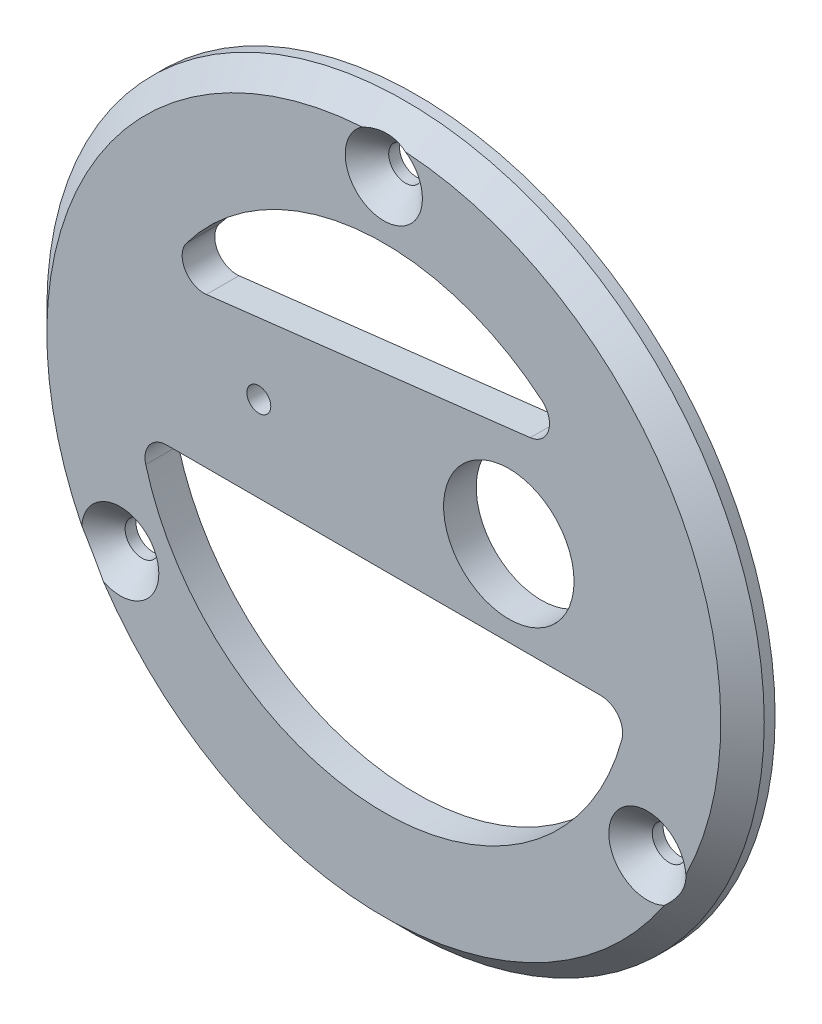
ISO-10303-21;
HEADER;
FILE_DESCRIPTION(('STEP AP214'),'2;1');
FILE_NAME('part.step','',(''),(''),'','','');
FILE_SCHEMA(('AUTOMOTIVE_DESIGN { 1 0 10303 214 1 1 1 1 }'));
ENDSEC;
DATA;
#1=APPLICATION_CONTEXT('core data for automotive mechanical design processes');
#2=APPLICATION_PROTOCOL_DEFINITION('international standard','automotive_design',2000,#1);
#3=PRODUCT_CONTEXT('',#1,'mechanical');
#4=PRODUCT('Part','Part','',(#3));
#5=PRODUCT_RELATED_PRODUCT_CATEGORY('part','',(#4));
#6=PRODUCT_DEFINITION_FORMATION('','',#4);
#7=PRODUCT_DEFINITION_CONTEXT('part definition',#1,'design');
#8=PRODUCT_DEFINITION('design','',#6,#7);
#9=PRODUCT_DEFINITION_SHAPE('','',#8);
#10=(LENGTH_UNIT() NAMED_UNIT(*) SI_UNIT(.MILLI.,.METRE.));
#11=(NAMED_UNIT(*) PLANE_ANGLE_UNIT() SI_UNIT($,.RADIAN.));
#12=(NAMED_UNIT(*) SI_UNIT($,.STERADIAN.) SOLID_ANGLE_UNIT());
#13=UNCERTAINTY_MEASURE_WITH_UNIT(LENGTH_MEASURE(1.E-05),#10,'distance_accuracy_value','');
#14=(GEOMETRIC_REPRESENTATION_CONTEXT(3) GLOBAL_UNCERTAINTY_ASSIGNED_CONTEXT((#13)) GLOBAL_UNIT_ASSIGNED_CONTEXT((#10,
#11,#12)) REPRESENTATION_CONTEXT('',''));
#15=CARTESIAN_POINT('',(0.,0.,0.));
#16=DIRECTION('',(0.,0.,1.));
#17=DIRECTION('',(1.,0.,0.));
#18=AXIS2_PLACEMENT_3D('',#15,#16,#17);
#19=CARTESIAN_POINT('',(0.,15.45,-3.));
#20=DIRECTION('',(0.,0.,1.));
#21=DIRECTION('',(1.,0.,0.));
#22=AXIS2_PLACEMENT_3D('',#19,#20,#21);
#23=CYLINDRICAL_SURFACE('',#22,33.);
#24=CARTESIAN_POINT('',(0.,15.45,42.));
#25=DIRECTION('',(0.,0.,1.));
#26=DIRECTION('',(1.,0.,0.));
#27=AXIS2_PLACEMENT_3D('',#24,#25,#26);
#28=CIRCLE('',#27,33.);
#29=CARTESIAN_POINT('',(33.,15.45,42.));
#30=VERTEX_POINT('',#29);
#31=EDGE_CURVE('E191',#30,#30,#28,.F.);
#32=ORIENTED_EDGE('',*,*,#31,.T.);
#33=EDGE_LOOP('',(#32));
#34=FACE_BOUND('',#33,.T.);
#35=CARTESIAN_POINT('',(0.,15.45,41.));
#36=DIRECTION('',(0.,0.,1.));
#37=DIRECTION('',(1.,0.,0.));
#38=AXIS2_PLACEMENT_3D('',#35,#36,#37);
#39=CIRCLE('',#38,33.);
#40=CARTESIAN_POINT('',(33.,15.45,41.));
#41=VERTEX_POINT('',#40);
#42=EDGE_CURVE('E175',#41,#41,#39,.T.);
#43=ORIENTED_EDGE('',*,*,#42,.T.);
#44=EDGE_LOOP('',(#43));
#45=FACE_BOUND('',#44,.T.);
#46=ADVANCED_FACE('F47',(#34,#45),#23,.T.);
#47=CARTESIAN_POINT('',(0.,15.45,44.));
#48=DIRECTION('',(0.,0.,1.));
#49=DIRECTION('',(1.,0.,0.));
#50=AXIS2_PLACEMENT_3D('',#47,#48,#49);
#51=PLANE('',#50);
#52=CARTESIAN_POINT('',(-11.5,19.9185842870421,44.));
#53=DIRECTION('',(0.,0.,1.));
#54=DIRECTION('',(1.,0.,0.));
#55=AXIS2_PLACEMENT_3D('',#52,#53,#54);
#56=CIRCLE('',#55,1.1);
#57=CARTESIAN_POINT('',(-10.4,19.9185842870421,44.));
#58=VERTEX_POINT('',#57);
#59=EDGE_CURVE('E232',#58,#58,#56,.T.);
#60=ORIENTED_EDGE('',*,*,#59,.F.);
#61=EDGE_LOOP('',(#60));
#62=FACE_BOUND('',#61,.T.);
#63=DIRECTION('',(0.993216518087136,0.116279612137581,0.));
#64=VECTOR('',#63,1.);
#65=CARTESIAN_POINT('',(-3.2085539649182,27.4062558220451,44.));
#66=LINE('',#65,#64);
#67=CARTESIAN_POINT('',(-16.320482538598,25.8711927807462,44.));
#68=VERTEX_POINT('',#67);
#69=CARTESIAN_POINT('',(13.4720413018586,29.359116162689,44.));
#70=VERTEX_POINT('',#69);
#71=EDGE_CURVE('E158',#68,#70,#66,.T.);
#72=ORIENTED_EDGE('',*,*,#71,.F.);
#73=CARTESIAN_POINT('',(-16.5530417628732,27.8576258169205,44.));
#74=DIRECTION('',(0.,0.,1.));
#75=DIRECTION('',(1.,0.,0.));
#76=AXIS2_PLACEMENT_3D('',#73,#74,#75);
#77=CIRCLE('',#76,2.);
#78=CARTESIAN_POINT('',(-18.1533737595177,29.0571830271092,44.));
#79=VERTEX_POINT('',#78);
#80=EDGE_CURVE('E225',#68,#79,#77,.F.);
#81=ORIENTED_EDGE('',*,*,#80,.T.);
#82=CARTESIAN_POINT('',(0.,15.45,44.));
#83=DIRECTION('',(0.,0.,1.));
#84=DIRECTION('',(1.,0.,0.));
#85=AXIS2_PLACEMENT_3D('',#82,#83,#84);
#86=CIRCLE('',#85,22.6870096924648);
#87=CARTESIAN_POINT('',(14.5194623429193,32.8823154531618,44.));
#88=VERTEX_POINT('',#87);
#89=EDGE_CURVE('E162',#88,#79,#86,.T.);
#90=ORIENTED_EDGE('',*,*,#89,.F.);
#91=CARTESIAN_POINT('',(13.2394820775834,31.3455491988632,44.));
#92=DIRECTION('',(0.,0.,1.));
#93=DIRECTION('',(1.,0.,0.));
#94=AXIS2_PLACEMENT_3D('',#91,#92,#93);
#95=CIRCLE('',#94,2.);
#96=EDGE_CURVE('E221',#88,#70,#95,.F.);
#97=ORIENTED_EDGE('',*,*,#96,.T.);
#98=EDGE_LOOP('',(#72,#81,#90,#97));
#99=FACE_BOUND('',#98,.T.);
#100=DIRECTION('',(-0.999999966814466,-0.000257625828715778,0.));
#101=VECTOR('',#100,1.);
#102=CARTESIAN_POINT('',(-0.00310639577921962,12.0577804314772,44.));
#103=LINE('',#102,#101);
#104=CARTESIAN_POINT('',(19.9727622042191,12.0629267313504,44.));
#105=VERTEX_POINT('',#104);
#106=CARTESIAN_POINT('',(-19.9710143579344,12.05263618247,44.));
#107=VERTEX_POINT('',#106);
#108=EDGE_CURVE('E159',#105,#107,#103,.T.);
#109=ORIENTED_EDGE('',*,*,#108,.F.);
#110=CARTESIAN_POINT('',(19.9732774558765,10.0629267977215,44.));
#111=DIRECTION('',(0.,0.,1.));
#112=DIRECTION('',(1.,0.,0.));
#113=AXIS2_PLACEMENT_3D('',#110,#111,#112);
#114=CIRCLE('',#113,2.);
#115=CARTESIAN_POINT('',(21.9042745166216,9.54210979397241,44.));
#116=VERTEX_POINT('',#115);
#117=EDGE_CURVE('E157',#105,#116,#114,.F.);
#118=ORIENTED_EDGE('',*,*,#117,.T.);
#119=CARTESIAN_POINT('',(0.,15.45,44.));
#120=DIRECTION('',(0.,0.,1.));
#121=DIRECTION('',(1.,0.,0.));
#122=AXIS2_PLACEMENT_3D('',#119,#120,#121);
#123=CIRCLE('',#122,22.6870096924648);
#124=CARTESIAN_POINT('',(-21.9012275588818,9.53082436482338,44.));
#125=VERTEX_POINT('',#124);
#126=EDGE_CURVE('E148',#125,#116,#123,.T.);
#127=ORIENTED_EDGE('',*,*,#126,.F.);
#128=CARTESIAN_POINT('',(-19.970499106277,10.0526362488411,44.));
#129=DIRECTION('',(0.,0.,1.));
#130=DIRECTION('',(1.,0.,0.));
#131=AXIS2_PLACEMENT_3D('',#128,#129,#130);
#132=CIRCLE('',#131,2.);
#133=EDGE_CURVE('E131',#125,#107,#132,.F.);
#134=ORIENTED_EDGE('',*,*,#133,.T.);
#135=EDGE_LOOP('',(#109,#118,#127,#134));
#136=FACE_BOUND('',#135,.T.);
#137=CARTESIAN_POINT('',(0.,15.45,44.));
#138=DIRECTION('',(0.,0.,1.));
#139=DIRECTION('',(1.,0.,0.));
#140=AXIS2_PLACEMENT_3D('',#137,#138,#139);
#141=CIRCLE('',#140,31.);
#142=CARTESIAN_POINT('',(-25.7930347440421,-1.74649262764462,44.));
#143=VERTEX_POINT('',#142);
#144=CARTESIAN_POINT('',(25.7930347440414,-1.74649262764578,44.));
#145=VERTEX_POINT('',#144);
#146=EDGE_CURVE('E189',#143,#145,#141,.T.);
#147=ORIENTED_EDGE('',*,*,#146,.T.);
#148=CARTESIAN_POINT('',(24.2487113059643,1.45,44.));
#149=DIRECTION('',(0.,0.,1.));
#150=DIRECTION('',(1.,0.,0.));
#151=AXIS2_PLACEMENT_3D('',#148,#149,#150);
#152=CIRCLE('',#151,3.54999999999832);
#153=CARTESIAN_POINT('',(27.7891168435537,1.71082298478844,44.));
#154=VERTEX_POINT('',#153);
#155=EDGE_CURVE('E241',#145,#154,#152,.F.);
#156=ORIENTED_EDGE('',*,*,#155,.T.);
#157=CARTESIAN_POINT('',(1.99608209951576,46.3856696428571,44.));
#158=VERTEX_POINT('',#157);
#159=EDGE_CURVE('E182',#154,#158,#141,.T.);
#160=ORIENTED_EDGE('',*,*,#159,.T.);
#161=CARTESIAN_POINT('',(0.,43.45,44.));
#162=DIRECTION('',(0.,0.,1.));
#163=DIRECTION('',(1.,0.,0.));
#164=AXIS2_PLACEMENT_3D('',#161,#162,#163);
#165=CIRCLE('',#164,3.55000000000004);
#166=CARTESIAN_POINT('',(-1.99608209951576,46.3856696428571,44.));
#167=VERTEX_POINT('',#166);
#168=EDGE_CURVE('E235',#158,#167,#165,.F.);
#169=ORIENTED_EDGE('',*,*,#168,.T.);
#170=CARTESIAN_POINT('',(-27.7891168435531,1.71082298478715,44.));
#171=VERTEX_POINT('',#170);
#172=EDGE_CURVE('E190',#167,#171,#141,.T.);
#173=ORIENTED_EDGE('',*,*,#172,.T.);
#174=CARTESIAN_POINT('',(-24.2487113059643,1.44999999999998,44.));
#175=DIRECTION('',(0.,0.,1.));
#176=DIRECTION('',(1.,0.,0.));
#177=AXIS2_PLACEMENT_3D('',#174,#175,#176);
#178=CIRCLE('',#177,3.54999999999758);
#179=EDGE_CURVE('E238',#171,#143,#178,.F.);
#180=ORIENTED_EDGE('',*,*,#179,.T.);
#181=EDGE_LOOP('',(#147,#156,#160,#169,#173,#180));
#182=FACE_BOUND('',#181,.T.);
#183=CARTESIAN_POINT('',(11.4999999999999,19.9185842870421,44.));
#184=DIRECTION('',(0.,0.,1.));
#185=DIRECTION('',(1.,0.,0.));
#186=AXIS2_PLACEMENT_3D('',#183,#184,#185);
#187=CIRCLE('',#186,6.);
#188=CARTESIAN_POINT('',(17.4999999999999,19.9185842870421,44.));
#189=VERTEX_POINT('',#188);
#190=EDGE_CURVE('E179',#189,#189,#187,.T.);
#191=ORIENTED_EDGE('',*,*,#190,.F.);
#192=EDGE_LOOP('',(#191));
#193=FACE_BOUND('',#192,.T.);
#194=ADVANCED_FACE('F155',(#62,#99,#136,#182,#193),#51,.T.);
#195=CARTESIAN_POINT('',(0.,15.45,41.));
#196=DIRECTION('',(0.,0.,1.));
#197=DIRECTION('',(1.,0.,0.));
#198=AXIS2_PLACEMENT_3D('',#195,#196,#197);
#199=PLANE('',#198);
#200=CARTESIAN_POINT('',(-11.5,19.9185842870421,41.));
#201=DIRECTION('',(0.,0.,1.));
#202=DIRECTION('',(1.,0.,0.));
#203=AXIS2_PLACEMENT_3D('',#200,#201,#202);
#204=CIRCLE('',#203,1.1);
#205=CARTESIAN_POINT('',(-10.4,19.9185842870421,41.));
#206=VERTEX_POINT('',#205);
#207=EDGE_CURVE('E164',#206,#206,#204,.T.);
#208=ORIENTED_EDGE('',*,*,#207,.T.);
#209=EDGE_LOOP('',(#208));
#210=FACE_BOUND('',#209,.T.);
#211=DIRECTION('',(0.993216518087136,0.116279612137581,0.));
#212=VECTOR('',#211,1.);
#213=CARTESIAN_POINT('',(-1.42422061836972,27.6151544717176,41.));
#214=LINE('',#213,#212);
#215=CARTESIAN_POINT('',(-16.320482538598,25.8711927807462,41.));
#216=VERTEX_POINT('',#215);
#217=CARTESIAN_POINT('',(13.4720413018586,29.359116162689,41.));
#218=VERTEX_POINT('',#217);
#219=EDGE_CURVE('E201',#216,#218,#214,.T.);
#220=ORIENTED_EDGE('',*,*,#219,.T.);
#221=CARTESIAN_POINT('',(13.2394820775834,31.3455491988632,41.));
#222=DIRECTION('',(0.,0.,1.));
#223=DIRECTION('',(1.,0.,0.));
#224=AXIS2_PLACEMENT_3D('',#221,#222,#223);
#225=CIRCLE('',#224,2.);
#226=CARTESIAN_POINT('',(14.5194623429193,32.8823154531618,41.));
#227=VERTEX_POINT('',#226);
#228=EDGE_CURVE('E223',#218,#227,#225,.T.);
#229=ORIENTED_EDGE('',*,*,#228,.T.);
#230=CARTESIAN_POINT('',(0.,15.45,41.));
#231=DIRECTION('',(0.,0.,1.));
#232=DIRECTION('',(1.,0.,0.));
#233=AXIS2_PLACEMENT_3D('',#230,#231,#232);
#234=CIRCLE('',#233,22.6870096924648);
#235=CARTESIAN_POINT('',(-18.1533737595177,29.0571830271092,41.));
#236=VERTEX_POINT('',#235);
#237=EDGE_CURVE('E198',#227,#236,#234,.T.);
#238=ORIENTED_EDGE('',*,*,#237,.T.);
#239=CARTESIAN_POINT('',(-16.5530417628732,27.8576258169205,41.));
#240=DIRECTION('',(0.,0.,1.));
#241=DIRECTION('',(1.,0.,0.));
#242=AXIS2_PLACEMENT_3D('',#239,#240,#241);
#243=CIRCLE('',#242,2.);
#244=EDGE_CURVE('E227',#236,#216,#243,.T.);
#245=ORIENTED_EDGE('',*,*,#244,.T.);
#246=EDGE_LOOP('',(#220,#229,#238,#245));
#247=FACE_BOUND('',#246,.T.);
#248=DIRECTION('',(-0.999999966814466,-0.000257625828715778,0.));
#249=VECTOR('',#248,1.);
#250=CARTESIAN_POINT('',(0.000873923142350145,12.0577814569102,41.));
#251=LINE('',#250,#249);
#252=CARTESIAN_POINT('',(19.9727622042191,12.0629267313504,41.));
#253=VERTEX_POINT('',#252);
#254=CARTESIAN_POINT('',(-19.9710143579344,12.05263618247,41.));
#255=VERTEX_POINT('',#254);
#256=EDGE_CURVE('E195',#253,#255,#251,.T.);
#257=ORIENTED_EDGE('',*,*,#256,.T.);
#258=CARTESIAN_POINT('',(-19.970499106277,10.0526362488411,41.));
#259=DIRECTION('',(0.,0.,1.));
#260=DIRECTION('',(1.,0.,0.));
#261=AXIS2_PLACEMENT_3D('',#258,#259,#260);
#262=CIRCLE('',#261,2.);
#263=CARTESIAN_POINT('',(-21.9012275588818,9.53082436482338,41.));
#264=VERTEX_POINT('',#263);
#265=EDGE_CURVE('E141',#255,#264,#262,.T.);
#266=ORIENTED_EDGE('',*,*,#265,.T.);
#267=CARTESIAN_POINT('',(0.,15.45,41.));
#268=DIRECTION('',(0.,0.,1.));
#269=DIRECTION('',(1.,0.,0.));
#270=AXIS2_PLACEMENT_3D('',#267,#268,#269);
#271=CIRCLE('',#270,22.6870096924648);
#272=CARTESIAN_POINT('',(21.9042745166216,9.54210979397241,41.));
#273=VERTEX_POINT('',#272);
#274=EDGE_CURVE('E151',#264,#273,#271,.T.);
#275=ORIENTED_EDGE('',*,*,#274,.T.);
#276=CARTESIAN_POINT('',(19.9732774558765,10.0629267977215,41.));
#277=DIRECTION('',(0.,0.,1.));
#278=DIRECTION('',(1.,0.,0.));
#279=AXIS2_PLACEMENT_3D('',#276,#277,#278);
#280=CIRCLE('',#279,2.);
#281=EDGE_CURVE('E219',#273,#253,#280,.T.);
#282=ORIENTED_EDGE('',*,*,#281,.T.);
#283=EDGE_LOOP('',(#257,#266,#275,#282));
#284=FACE_BOUND('',#283,.T.);
#285=CARTESIAN_POINT('',(11.4999999999999,19.9185842870421,41.));
#286=DIRECTION('',(0.,0.,1.));
#287=DIRECTION('',(1.,0.,0.));
#288=AXIS2_PLACEMENT_3D('',#285,#286,#287);
#289=CIRCLE('',#288,6.);
#290=CARTESIAN_POINT('',(17.4999999999999,19.9185842870421,41.));
#291=VERTEX_POINT('',#290);
#292=EDGE_CURVE('E178',#291,#291,#289,.T.);
#293=ORIENTED_EDGE('',*,*,#292,.T.);
#294=EDGE_LOOP('',(#293));
#295=FACE_BOUND('',#294,.T.);
#296=CARTESIAN_POINT('',(24.2487113059643,1.45,41.));
#297=DIRECTION('',(0.,0.,1.));
#298=DIRECTION('',(1.,0.,0.));
#299=AXIS2_PLACEMENT_3D('',#296,#297,#298);
#300=CIRCLE('',#299,1.54999999999826);
#301=CARTESIAN_POINT('',(25.7987113059626,1.45,41.));
#302=VERTEX_POINT('',#301);
#303=EDGE_CURVE('E168',#302,#302,#300,.F.);
#304=ORIENTED_EDGE('',*,*,#303,.F.);
#305=EDGE_LOOP('',(#304));
#306=FACE_BOUND('',#305,.T.);
#307=CARTESIAN_POINT('',(0.,43.45,41.));
#308=DIRECTION('',(0.,0.,1.));
#309=DIRECTION('',(1.,0.,0.));
#310=AXIS2_PLACEMENT_3D('',#307,#308,#309);
#311=CIRCLE('',#310,1.55);
#312=CARTESIAN_POINT('',(1.55,43.45,41.));
#313=VERTEX_POINT('',#312);
#314=EDGE_CURVE('E172',#313,#313,#311,.F.);
#315=ORIENTED_EDGE('',*,*,#314,.F.);
#316=EDGE_LOOP('',(#315));
#317=FACE_BOUND('',#316,.T.);
#318=CARTESIAN_POINT('',(-24.2487113059643,1.44999999999998,41.));
#319=DIRECTION('',(0.,0.,1.));
#320=DIRECTION('',(1.,0.,0.));
#321=AXIS2_PLACEMENT_3D('',#318,#319,#320);
#322=CIRCLE('',#321,1.54999999999759);
#323=CARTESIAN_POINT('',(-22.6987113059667,1.44999999999998,41.));
#324=VERTEX_POINT('',#323);
#325=EDGE_CURVE('E171',#324,#324,#322,.F.);
#326=ORIENTED_EDGE('',*,*,#325,.F.);
#327=EDGE_LOOP('',(#326));
#328=FACE_BOUND('',#327,.T.);
#329=ORIENTED_EDGE('',*,*,#42,.F.);
#330=EDGE_LOOP('',(#329));
#331=FACE_BOUND('',#330,.T.);
#332=ADVANCED_FACE('F294',(#210,#247,#284,#295,#306,#317,#328,#331),#199,.F.);
#333=CARTESIAN_POINT('',(11.4999999999999,19.9185842870421,44.));
#334=DIRECTION('',(0.,0.,-1.));
#335=DIRECTION('',(-1.,0.,0.));
#336=AXIS2_PLACEMENT_3D('',#333,#334,#335);
#337=CYLINDRICAL_SURFACE('',#336,6.);
#338=ORIENTED_EDGE('',*,*,#190,.T.);
#339=EDGE_LOOP('',(#338));
#340=FACE_BOUND('',#339,.T.);
#341=ORIENTED_EDGE('',*,*,#292,.F.);
#342=EDGE_LOOP('',(#341));
#343=FACE_BOUND('',#342,.T.);
#344=ADVANCED_FACE('F302',(#340,#343),#337,.F.);
#345=CARTESIAN_POINT('',(-24.2487113059643,1.44999999999998,-2.));
#346=DIRECTION('',(0.,0.,1.));
#347=DIRECTION('',(1.,0.,0.));
#348=AXIS2_PLACEMENT_3D('',#345,#346,#347);
#349=CYLINDRICAL_SURFACE('',#348,1.54999999999759);
#350=CARTESIAN_POINT('',(-24.2487113059643,1.44999999999998,42.));
#351=DIRECTION('',(0.,0.,1.));
#352=DIRECTION('',(1.,0.,0.));
#353=AXIS2_PLACEMENT_3D('',#350,#351,#352);
#354=CIRCLE('',#353,1.54999999999759);
#355=CARTESIAN_POINT('',(-22.6987113059667,1.44999999999998,42.));
#356=VERTEX_POINT('',#355);
#357=EDGE_CURVE('E56',#356,#356,#354,.T.);
#358=CARTESIAN_POINT('',(-22.6987113059667,1.44999999999998,42.));
#359=CARTESIAN_POINT('',(-22.6987113059667,1.44999999999998,41.9895833333333));
#360=CARTESIAN_POINT('',(-22.6987113059667,1.44999999999998,41.9791666666667));
#361=CARTESIAN_POINT('',(-22.6987113059667,1.44999999999998,41.9583333333333));
#362=CARTESIAN_POINT('',(-22.6987113059667,1.44999999999998,41.9479166666667));
#363=CARTESIAN_POINT('',(-22.6987113059667,1.44999999999998,41.9270833333333));
#364=CARTESIAN_POINT('',(-22.6987113059667,1.44999999999998,41.9166666666667));
#365=CARTESIAN_POINT('',(-22.6987113059667,1.44999999999998,41.8958333333333));
#366=CARTESIAN_POINT('',(-22.6987113059667,1.44999999999998,41.8854166666667));
#367=CARTESIAN_POINT('',(-22.6987113059667,1.44999999999998,41.8645833333333));
#368=CARTESIAN_POINT('',(-22.6987113059667,1.44999999999998,41.8541666666667));
#369=CARTESIAN_POINT('',(-22.6987113059667,1.44999999999998,41.8333333333333));
#370=CARTESIAN_POINT('',(-22.6987113059667,1.44999999999998,41.8229166666667));
#371=CARTESIAN_POINT('',(-22.6987113059667,1.44999999999998,41.8020833333333));
#372=CARTESIAN_POINT('',(-22.6987113059667,1.44999999999998,41.7916666666667));
#373=CARTESIAN_POINT('',(-22.6987113059667,1.44999999999998,41.7708333333333));
#374=CARTESIAN_POINT('',(-22.6987113059667,1.44999999999998,41.7604166666667));
#375=CARTESIAN_POINT('',(-22.6987113059667,1.44999999999998,41.7395833333333));
#376=CARTESIAN_POINT('',(-22.6987113059667,1.44999999999998,41.7291666666667));
#377=CARTESIAN_POINT('',(-22.6987113059667,1.44999999999998,41.7083333333333));
#378=CARTESIAN_POINT('',(-22.6987113059667,1.44999999999998,41.6979166666667));
#379=CARTESIAN_POINT('',(-22.6987113059667,1.44999999999998,41.6770833333333));
#380=CARTESIAN_POINT('',(-22.6987113059667,1.44999999999998,41.6666666666667));
#381=CARTESIAN_POINT('',(-22.6987113059667,1.44999999999998,41.6458333333333));
#382=CARTESIAN_POINT('',(-22.6987113059667,1.44999999999998,41.6354166666667));
#383=CARTESIAN_POINT('',(-22.6987113059667,1.44999999999998,41.6145833333333));
#384=CARTESIAN_POINT('',(-22.6987113059667,1.44999999999998,41.6041666666667));
#385=CARTESIAN_POINT('',(-22.6987113059667,1.44999999999998,41.5833333333333));
#386=CARTESIAN_POINT('',(-22.6987113059667,1.44999999999998,41.5729166666667));
#387=CARTESIAN_POINT('',(-22.6987113059667,1.44999999999998,41.5520833333333));
#388=CARTESIAN_POINT('',(-22.6987113059667,1.44999999999998,41.5416666666667));
#389=CARTESIAN_POINT('',(-22.6987113059667,1.44999999999998,41.5208333333333));
#390=CARTESIAN_POINT('',(-22.6987113059667,1.44999999999998,41.5104166666667));
#391=CARTESIAN_POINT('',(-22.6987113059667,1.44999999999998,41.4895833333333));
#392=CARTESIAN_POINT('',(-22.6987113059667,1.44999999999998,41.4791666666667));
#393=CARTESIAN_POINT('',(-22.6987113059667,1.44999999999998,41.4583333333333));
#394=CARTESIAN_POINT('',(-22.6987113059667,1.44999999999998,41.4479166666667));
#395=CARTESIAN_POINT('',(-22.6987113059667,1.44999999999998,41.4270833333333));
#396=CARTESIAN_POINT('',(-22.6987113059667,1.44999999999998,41.4166666666667));
#397=CARTESIAN_POINT('',(-22.6987113059667,1.44999999999998,41.3958333333333));
#398=CARTESIAN_POINT('',(-22.6987113059667,1.44999999999998,41.3854166666667));
#399=CARTESIAN_POINT('',(-22.6987113059667,1.44999999999998,41.3645833333333));
#400=CARTESIAN_POINT('',(-22.6987113059667,1.44999999999998,41.3541666666667));
#401=CARTESIAN_POINT('',(-22.6987113059667,1.44999999999998,41.3333333333333));
#402=CARTESIAN_POINT('',(-22.6987113059667,1.44999999999998,41.3229166666667));
#403=CARTESIAN_POINT('',(-22.6987113059667,1.44999999999998,41.3020833333333));
#404=CARTESIAN_POINT('',(-22.6987113059667,1.44999999999998,41.2916666666667));
#405=CARTESIAN_POINT('',(-22.6987113059667,1.44999999999998,41.2708333333333));
#406=CARTESIAN_POINT('',(-22.6987113059667,1.44999999999998,41.2604166666667));
#407=CARTESIAN_POINT('',(-22.6987113059667,1.44999999999998,41.2395833333333));
#408=CARTESIAN_POINT('',(-22.6987113059667,1.44999999999998,41.2291666666667));
#409=CARTESIAN_POINT('',(-22.6987113059667,1.44999999999998,41.2083333333333));
#410=CARTESIAN_POINT('',(-22.6987113059667,1.44999999999998,41.1979166666667));
#411=CARTESIAN_POINT('',(-22.6987113059667,1.44999999999998,41.1770833333333));
#412=CARTESIAN_POINT('',(-22.6987113059667,1.44999999999998,41.1666666666667));
#413=CARTESIAN_POINT('',(-22.6987113059667,1.44999999999998,41.1458333333333));
#414=CARTESIAN_POINT('',(-22.6987113059667,1.44999999999998,41.1354166666667));
#415=CARTESIAN_POINT('',(-22.6987113059667,1.44999999999998,41.1145833333333));
#416=CARTESIAN_POINT('',(-22.6987113059667,1.44999999999998,41.1041666666667));
#417=CARTESIAN_POINT('',(-22.6987113059667,1.44999999999998,41.0833333333333));
#418=CARTESIAN_POINT('',(-22.6987113059667,1.44999999999998,41.0729166666667));
#419=CARTESIAN_POINT('',(-22.6987113059667,1.44999999999998,41.0520833333333));
#420=CARTESIAN_POINT('',(-22.6987113059667,1.44999999999998,41.0416666666667));
#421=CARTESIAN_POINT('',(-22.6987113059667,1.44999999999998,41.0208333333333));
#422=CARTESIAN_POINT('',(-22.6987113059667,1.44999999999998,41.0104166666667));
#423=CARTESIAN_POINT('',(-22.6987113059667,1.44999999999998,41.));
#424=B_SPLINE_CURVE_WITH_KNOTS('',3,(#358,#359,#360,#361,#362,#363,#364,#365,#366,#367,#368,
#369,#370,#371,#372,#373,#374,#375,#376,#377,#378,#379,#380,#381,#382,#383,#384,#385,#386,#387,
#388,#389,#390,#391,#392,#393,#394,#395,#396,#397,#398,#399,#400,#401,#402,#403,#404,#405,#406,
#407,#408,#409,#410,#411,#412,#413,#414,#415,#416,#417,#418,#419,#420,#421,#422,#423),
.UNSPECIFIED.,.F.,.F.,(4,2,2,2,2,2,2,2,2,2,2,2,2,2,2,2,2,2,2,2,2,2,2,2,2,2,2,2,2,2,2,2,4),(0.,
0.0312499999999966,0.0625000000000001,0.0937500000000036,0.125,0.156249999999997,0.1875,
0.218750000000004,0.25,0.281249999999997,0.3125,0.343750000000004,0.375,0.406249999999997,
0.4375,0.468750000000004,0.5,0.531249999999997,0.5625,0.593750000000004,0.625000000000001,
0.656249999999997,0.687500000000001,0.718750000000004,0.750000000000001,0.781249999999997,
0.812500000000001,0.843750000000004,0.875000000000001,0.906249999999997,0.937500000000001,
0.968750000000004,1.),.UNSPECIFIED.);
#425=EDGE_CURVE('BSEAM308',#356,#324,#424,.T.);
#426=ORIENTED_EDGE('',*,*,#357,.T.);
#427=ORIENTED_EDGE('',*,*,#325,.T.);
#428=ORIENTED_EDGE('',*,*,#425,.T.);
#429=ORIENTED_EDGE('',*,*,#425,.F.);
#430=EDGE_LOOP('',(#426,#428,#427,#429));
#431=FACE_BOUND('',#430,.T.);
#432=ADVANCED_FACE('F308',(#431),#349,.F.);
#433=CARTESIAN_POINT('',(24.2487113059643,1.45,-2.));
#434=DIRECTION('',(0.,0.,1.));
#435=DIRECTION('',(1.,0.,0.));
#436=AXIS2_PLACEMENT_3D('',#433,#434,#435);
#437=CYLINDRICAL_SURFACE('',#436,1.54999999999826);
#438=CARTESIAN_POINT('',(24.2487113059643,1.45,42.));
#439=DIRECTION('',(0.,0.,1.));
#440=DIRECTION('',(1.,0.,0.));
#441=AXIS2_PLACEMENT_3D('',#438,#439,#440);
#442=CIRCLE('',#441,1.54999999999826);
#443=CARTESIAN_POINT('',(25.7987113059626,1.45,42.));
#444=VERTEX_POINT('',#443);
#445=EDGE_CURVE('E229',#444,#444,#442,.T.);
#446=CARTESIAN_POINT('',(25.7987113059626,1.45,42.));
#447=CARTESIAN_POINT('',(25.7987113059626,1.45,41.9895833333333));
#448=CARTESIAN_POINT('',(25.7987113059626,1.45,41.9791666666667));
#449=CARTESIAN_POINT('',(25.7987113059626,1.45,41.9583333333333));
#450=CARTESIAN_POINT('',(25.7987113059626,1.45,41.9479166666667));
#451=CARTESIAN_POINT('',(25.7987113059626,1.45,41.9270833333333));
#452=CARTESIAN_POINT('',(25.7987113059626,1.45,41.9166666666667));
#453=CARTESIAN_POINT('',(25.7987113059626,1.45,41.8958333333333));
#454=CARTESIAN_POINT('',(25.7987113059626,1.45,41.8854166666667));
#455=CARTESIAN_POINT('',(25.7987113059626,1.45,41.8645833333333));
#456=CARTESIAN_POINT('',(25.7987113059626,1.45,41.8541666666667));
#457=CARTESIAN_POINT('',(25.7987113059626,1.45,41.8333333333333));
#458=CARTESIAN_POINT('',(25.7987113059626,1.45,41.8229166666667));
#459=CARTESIAN_POINT('',(25.7987113059626,1.45,41.8020833333333));
#460=CARTESIAN_POINT('',(25.7987113059626,1.45,41.7916666666667));
#461=CARTESIAN_POINT('',(25.7987113059626,1.45,41.7708333333333));
#462=CARTESIAN_POINT('',(25.7987113059626,1.45,41.7604166666667));
#463=CARTESIAN_POINT('',(25.7987113059626,1.45,41.7395833333333));
#464=CARTESIAN_POINT('',(25.7987113059626,1.45,41.7291666666667));
#465=CARTESIAN_POINT('',(25.7987113059626,1.45,41.7083333333333));
#466=CARTESIAN_POINT('',(25.7987113059626,1.45,41.6979166666667));
#467=CARTESIAN_POINT('',(25.7987113059626,1.45,41.6770833333333));
#468=CARTESIAN_POINT('',(25.7987113059626,1.45,41.6666666666667));
#469=CARTESIAN_POINT('',(25.7987113059626,1.45,41.6458333333333));
#470=CARTESIAN_POINT('',(25.7987113059626,1.45,41.6354166666667));
#471=CARTESIAN_POINT('',(25.7987113059626,1.45,41.6145833333333));
#472=CARTESIAN_POINT('',(25.7987113059626,1.45,41.6041666666667));
#473=CARTESIAN_POINT('',(25.7987113059626,1.45,41.5833333333333));
#474=CARTESIAN_POINT('',(25.7987113059626,1.45,41.5729166666667));
#475=CARTESIAN_POINT('',(25.7987113059626,1.45,41.5520833333333));
#476=CARTESIAN_POINT('',(25.7987113059626,1.45,41.5416666666667));
#477=CARTESIAN_POINT('',(25.7987113059626,1.45,41.5208333333333));
#478=CARTESIAN_POINT('',(25.7987113059626,1.45,41.5104166666667));
#479=CARTESIAN_POINT('',(25.7987113059626,1.45,41.4895833333333));
#480=CARTESIAN_POINT('',(25.7987113059626,1.45,41.4791666666667));
#481=CARTESIAN_POINT('',(25.7987113059626,1.45,41.4583333333333));
#482=CARTESIAN_POINT('',(25.7987113059626,1.45,41.4479166666667));
#483=CARTESIAN_POINT('',(25.7987113059626,1.45,41.4270833333333));
#484=CARTESIAN_POINT('',(25.7987113059626,1.45,41.4166666666667));
#485=CARTESIAN_POINT('',(25.7987113059626,1.45,41.3958333333333));
#486=CARTESIAN_POINT('',(25.7987113059626,1.45,41.3854166666667));
#487=CARTESIAN_POINT('',(25.7987113059626,1.45,41.3645833333333));
#488=CARTESIAN_POINT('',(25.7987113059626,1.45,41.3541666666667));
#489=CARTESIAN_POINT('',(25.7987113059626,1.45,41.3333333333333));
#490=CARTESIAN_POINT('',(25.7987113059626,1.45,41.3229166666667));
#491=CARTESIAN_POINT('',(25.7987113059626,1.45,41.3020833333333));
#492=CARTESIAN_POINT('',(25.7987113059626,1.45,41.2916666666667));
#493=CARTESIAN_POINT('',(25.7987113059626,1.45,41.2708333333333));
#494=CARTESIAN_POINT('',(25.7987113059626,1.45,41.2604166666667));
#495=CARTESIAN_POINT('',(25.7987113059626,1.45,41.2395833333333));
#496=CARTESIAN_POINT('',(25.7987113059626,1.45,41.2291666666667));
#497=CARTESIAN_POINT('',(25.7987113059626,1.45,41.2083333333333));
#498=CARTESIAN_POINT('',(25.7987113059626,1.45,41.1979166666667));
#499=CARTESIAN_POINT('',(25.7987113059626,1.45,41.1770833333333));
#500=CARTESIAN_POINT('',(25.7987113059626,1.45,41.1666666666667));
#501=CARTESIAN_POINT('',(25.7987113059626,1.45,41.1458333333333));
#502=CARTESIAN_POINT('',(25.7987113059626,1.45,41.1354166666667));
#503=CARTESIAN_POINT('',(25.7987113059626,1.45,41.1145833333333));
#504=CARTESIAN_POINT('',(25.7987113059626,1.45,41.1041666666667));
#505=CARTESIAN_POINT('',(25.7987113059626,1.45,41.0833333333333));
#506=CARTESIAN_POINT('',(25.7987113059626,1.45,41.0729166666667));
#507=CARTESIAN_POINT('',(25.7987113059626,1.45,41.0520833333333));
#508=CARTESIAN_POINT('',(25.7987113059626,1.45,41.0416666666667));
#509=CARTESIAN_POINT('',(25.7987113059626,1.45,41.0208333333333));
#510=CARTESIAN_POINT('',(25.7987113059626,1.45,41.0104166666667));
#511=CARTESIAN_POINT('',(25.7987113059626,1.45,41.));
#512=B_SPLINE_CURVE_WITH_KNOTS('',3,(#446,#447,#448,#449,#450,#451,#452,#453,#454,#455,#456,
#457,#458,#459,#460,#461,#462,#463,#464,#465,#466,#467,#468,#469,#470,#471,#472,#473,#474,#475,
#476,#477,#478,#479,#480,#481,#482,#483,#484,#485,#486,#487,#488,#489,#490,#491,#492,#493,#494,
#495,#496,#497,#498,#499,#500,#501,#502,#503,#504,#505,#506,#507,#508,#509,#510,#511),
.UNSPECIFIED.,.F.,.F.,(4,2,2,2,2,2,2,2,2,2,2,2,2,2,2,2,2,2,2,2,2,2,2,2,2,2,2,2,2,2,2,2,4),(0.,
0.0312499999999966,0.0625000000000001,0.0937499999999966,0.125,0.156249999999997,0.1875,
0.218749999999997,0.25,0.281249999999997,0.312499999999993,0.343749999999997,0.374999999999993,
0.406249999999997,0.437499999999993,0.468749999999997,0.499999999999994,0.53124999999999,
0.562499999999994,0.59374999999999,0.624999999999994,0.65624999999999,0.687499999999994,
0.71874999999999,0.749999999999987,0.78124999999999,0.812499999999987,0.84374999999999,
0.874999999999987,0.90624999999999,0.937499999999987,0.96874999999999,0.999999999999987),.UNSPECIFIED.);
#513=EDGE_CURVE('BSEAM315',#444,#302,#512,.T.);
#514=ORIENTED_EDGE('',*,*,#445,.T.);
#515=ORIENTED_EDGE('',*,*,#303,.T.);
#516=ORIENTED_EDGE('',*,*,#513,.T.);
#517=ORIENTED_EDGE('',*,*,#513,.F.);
#518=EDGE_LOOP('',(#514,#516,#515,#517));
#519=FACE_BOUND('',#518,.T.);
#520=ADVANCED_FACE('F315',(#519),#437,.F.);
#521=CARTESIAN_POINT('',(0.,43.45,-2.));
#522=DIRECTION('',(0.,0.,1.));
#523=DIRECTION('',(1.,0.,0.));
#524=AXIS2_PLACEMENT_3D('',#521,#522,#523);
#525=CYLINDRICAL_SURFACE('',#524,1.55);
#526=CARTESIAN_POINT('',(0.,43.45,42.));
#527=DIRECTION('',(0.,0.,1.));
#528=DIRECTION('',(1.,0.,0.));
#529=AXIS2_PLACEMENT_3D('',#526,#527,#528);
#530=CIRCLE('',#529,1.55);
#531=CARTESIAN_POINT('',(1.55,43.45,42.));
#532=VERTEX_POINT('',#531);
#533=EDGE_CURVE('E12',#532,#532,#530,.T.);
#534=CARTESIAN_POINT('',(1.55,43.45,42.));
#535=CARTESIAN_POINT('',(1.55,43.45,41.9895833333333));
#536=CARTESIAN_POINT('',(1.55,43.45,41.9791666666667));
#537=CARTESIAN_POINT('',(1.55,43.45,41.9583333333333));
#538=CARTESIAN_POINT('',(1.55,43.45,41.9479166666667));
#539=CARTESIAN_POINT('',(1.55,43.45,41.9270833333333));
#540=CARTESIAN_POINT('',(1.55,43.45,41.9166666666667));
#541=CARTESIAN_POINT('',(1.55,43.45,41.8958333333333));
#542=CARTESIAN_POINT('',(1.55,43.45,41.8854166666667));
#543=CARTESIAN_POINT('',(1.55,43.45,41.8645833333333));
#544=CARTESIAN_POINT('',(1.55,43.45,41.8541666666667));
#545=CARTESIAN_POINT('',(1.55,43.45,41.8333333333333));
#546=CARTESIAN_POINT('',(1.55,43.45,41.8229166666667));
#547=CARTESIAN_POINT('',(1.55,43.45,41.8020833333333));
#548=CARTESIAN_POINT('',(1.55,43.45,41.7916666666667));
#549=CARTESIAN_POINT('',(1.55,43.45,41.7708333333333));
#550=CARTESIAN_POINT('',(1.55,43.45,41.7604166666667));
#551=CARTESIAN_POINT('',(1.55,43.45,41.7395833333333));
#552=CARTESIAN_POINT('',(1.55,43.45,41.7291666666667));
#553=CARTESIAN_POINT('',(1.55,43.45,41.7083333333333));
#554=CARTESIAN_POINT('',(1.55,43.45,41.6979166666667));
#555=CARTESIAN_POINT('',(1.55,43.45,41.6770833333333));
#556=CARTESIAN_POINT('',(1.55,43.45,41.6666666666667));
#557=CARTESIAN_POINT('',(1.55,43.45,41.6458333333333));
#558=CARTESIAN_POINT('',(1.55,43.45,41.6354166666667));
#559=CARTESIAN_POINT('',(1.55,43.45,41.6145833333333));
#560=CARTESIAN_POINT('',(1.55,43.45,41.6041666666667));
#561=CARTESIAN_POINT('',(1.55,43.45,41.5833333333333));
#562=CARTESIAN_POINT('',(1.55,43.45,41.5729166666667));
#563=CARTESIAN_POINT('',(1.55,43.45,41.5520833333333));
#564=CARTESIAN_POINT('',(1.55,43.45,41.5416666666667));
#565=CARTESIAN_POINT('',(1.55,43.45,41.5208333333333));
#566=CARTESIAN_POINT('',(1.55,43.45,41.5104166666667));
#567=CARTESIAN_POINT('',(1.55,43.45,41.4895833333333));
#568=CARTESIAN_POINT('',(1.55,43.45,41.4791666666667));
#569=CARTESIAN_POINT('',(1.55,43.45,41.4583333333333));
#570=CARTESIAN_POINT('',(1.55,43.45,41.4479166666667));
#571=CARTESIAN_POINT('',(1.55,43.45,41.4270833333333));
#572=CARTESIAN_POINT('',(1.55,43.45,41.4166666666667));
#573=CARTESIAN_POINT('',(1.55,43.45,41.3958333333333));
#574=CARTESIAN_POINT('',(1.55,43.45,41.3854166666667));
#575=CARTESIAN_POINT('',(1.55,43.45,41.3645833333333));
#576=CARTESIAN_POINT('',(1.55,43.45,41.3541666666667));
#577=CARTESIAN_POINT('',(1.55,43.45,41.3333333333333));
#578=CARTESIAN_POINT('',(1.55,43.45,41.3229166666667));
#579=CARTESIAN_POINT('',(1.55,43.45,41.3020833333333));
#580=CARTESIAN_POINT('',(1.55,43.45,41.2916666666667));
#581=CARTESIAN_POINT('',(1.55,43.45,41.2708333333333));
#582=CARTESIAN_POINT('',(1.55,43.45,41.2604166666667));
#583=CARTESIAN_POINT('',(1.55,43.45,41.2395833333333));
#584=CARTESIAN_POINT('',(1.55,43.45,41.2291666666667));
#585=CARTESIAN_POINT('',(1.55,43.45,41.2083333333333));
#586=CARTESIAN_POINT('',(1.55,43.45,41.1979166666667));
#587=CARTESIAN_POINT('',(1.55,43.45,41.1770833333333));
#588=CARTESIAN_POINT('',(1.55,43.45,41.1666666666667));
#589=CARTESIAN_POINT('',(1.55,43.45,41.1458333333333));
#590=CARTESIAN_POINT('',(1.55,43.45,41.1354166666667));
#591=CARTESIAN_POINT('',(1.55,43.45,41.1145833333333));
#592=CARTESIAN_POINT('',(1.55,43.45,41.1041666666667));
#593=CARTESIAN_POINT('',(1.55,43.45,41.0833333333333));
#594=CARTESIAN_POINT('',(1.55,43.45,41.0729166666667));
#595=CARTESIAN_POINT('',(1.55,43.45,41.0520833333333));
#596=CARTESIAN_POINT('',(1.55,43.45,41.0416666666667));
#597=CARTESIAN_POINT('',(1.55,43.45,41.0208333333333));
#598=CARTESIAN_POINT('',(1.55,43.45,41.0104166666667));
#599=CARTESIAN_POINT('',(1.55,43.45,41.));
#600=B_SPLINE_CURVE_WITH_KNOTS('',3,(#534,#535,#536,#537,#538,#539,#540,#541,#542,#543,#544,
#545,#546,#547,#548,#549,#550,#551,#552,#553,#554,#555,#556,#557,#558,#559,#560,#561,#562,#563,
#564,#565,#566,#567,#568,#569,#570,#571,#572,#573,#574,#575,#576,#577,#578,#579,#580,#581,#582,
#583,#584,#585,#586,#587,#588,#589,#590,#591,#592,#593,#594,#595,#596,#597,#598,#599),
.UNSPECIFIED.,.F.,.F.,(4,2,2,2,2,2,2,2,2,2,2,2,2,2,2,2,2,2,2,2,2,2,2,2,2,2,2,2,2,2,2,2,4),(0.,
0.0312499999999966,0.0625000000000001,0.0937499999999966,0.125,0.156249999999997,0.1875,
0.218749999999997,0.25,0.281249999999997,0.312499999999993,0.343749999999997,0.374999999999993,
0.406249999999997,0.437499999999993,0.468749999999997,0.499999999999994,0.53124999999999,
0.562499999999994,0.59374999999999,0.624999999999994,0.65624999999999,0.687499999999994,
0.71874999999999,0.749999999999987,0.78124999999999,0.812499999999987,0.84374999999999,
0.874999999999987,0.90624999999999,0.937499999999987,0.96874999999999,0.999999999999987),.UNSPECIFIED.);
#601=EDGE_CURVE('BSEAM262',#532,#313,#600,.T.);
#602=ORIENTED_EDGE('',*,*,#533,.T.);
#603=ORIENTED_EDGE('',*,*,#314,.T.);
#604=ORIENTED_EDGE('',*,*,#601,.T.);
#605=ORIENTED_EDGE('',*,*,#601,.F.);
#606=EDGE_LOOP('',(#602,#604,#603,#605));
#607=FACE_BOUND('',#606,.T.);
#608=ADVANCED_FACE('F262',(#607),#525,.F.);
#609=CARTESIAN_POINT('',(0.,15.45,44.));
#610=DIRECTION('',(0.,0.,-1.));
#611=DIRECTION('',(-1.,0.,0.));
#612=AXIS2_PLACEMENT_3D('',#609,#610,#611);
#613=CONICAL_SURFACE('',#612,31.,0.78539816339745);
#614=ORIENTED_EDGE('',*,*,#31,.F.);
#615=EDGE_LOOP('',(#614));
#616=FACE_BOUND('',#615,.T.);
#617=ORIENTED_EDGE('',*,*,#159,.F.);
#618=CARTESIAN_POINT('',(27.7891168435537,1.71082298478843,44.));
#619=CARTESIAN_POINT('',(27.7619300061005,1.57142313457697,43.9625947287152));
#620=CARTESIAN_POINT('',(27.7300092283673,1.43198438496855,43.9284961825511));
#621=CARTESIAN_POINT('',(27.6563188016805,1.15397566208255,43.8675634983051));
#622=CARTESIAN_POINT('',(27.6145389895433,1.01540673780789,43.840736918259));
#623=CARTESIAN_POINT('',(27.520931638247,0.740750849523276,43.7951414102762));
#624=CARTESIAN_POINT('',(27.4691316918654,0.604658167533531,43.7763507995311));
#625=CARTESIAN_POINT('',(27.3554232055937,0.335887980055289,43.7472480971477));
#626=CARTESIAN_POINT('',(27.2935192163628,0.203208968116193,43.7369322012277));
#627=CARTESIAN_POINT('',(27.1622694013656,-0.0528643717196207,43.7252856633066));
#628=CARTESIAN_POINT('',(27.0932676560049,-0.176421072316317,43.7236477355097));
#629=CARTESIAN_POINT('',(26.9466632428431,-0.418182297625971,43.7285771403339));
#630=CARTESIAN_POINT('',(26.8690589501436,-0.536385805237751,43.7351460255197));
#631=CARTESIAN_POINT('',(26.7061401621146,-0.766381671853585,43.756293016102));
#632=CARTESIAN_POINT('',(26.6208345320928,-0.878181166342237,43.7708620080665));
#633=CARTESIAN_POINT('',(26.4434003051793,-1.0948239839775,43.8076073596537));
#634=CARTESIAN_POINT('',(26.3512742230317,-1.19966984420777,43.8297809262667));
#635=CARTESIAN_POINT('',(26.1821890589091,-1.37967979294155,43.8755105369363));
#636=CARTESIAN_POINT('',(26.1063745321504,-1.45628477581334,43.897679417167));
#637=CARTESIAN_POINT('',(25.9518183270063,-1.60484019583375,43.9459576492599));
#638=CARTESIAN_POINT('',(25.8730829714803,-1.67679985767811,43.9720588255235));
#639=CARTESIAN_POINT('',(25.7930347440414,-1.74649262764578,44.));
#640=B_SPLINE_CURVE_WITH_KNOTS('',3,(#618,#619,#620,#621,#622,#623,#624,#625,#626,#627,#628,
#629,#630,#631,#632,#633,#634,#635,#636,#637,#638,#639),.UNSPECIFIED.,.F.,.F.,(4,2,2,2,2,2,2,2,
2,2,4),(0.,0.440602570318859,0.881661335268508,1.3215224011457,1.76118590625313,
2.18517155963253,2.60923743475598,3.03282122855201,3.45624961473151,3.78615118413085,
4.11537608975864),.UNSPECIFIED.);
#641=EDGE_CURVE('E62',#154,#145,#640,.T.);
#642=ORIENTED_EDGE('',*,*,#641,.T.);
#643=ORIENTED_EDGE('',*,*,#146,.F.);
#644=CARTESIAN_POINT('',(-25.7930347440421,-1.74649262764462,44.));
#645=CARTESIAN_POINT('',(-25.9001651368824,-1.65324821065584,43.9625947287153));
#646=CARTESIAN_POINT('',(-26.0049622474485,-1.55588463142614,43.9284961825512));
#647=CARTESIAN_POINT('',(-26.2088796505979,-1.35306248845662,43.8675634983052));
#648=CARTESIAN_POINT('',(-26.3079939531263,-1.2475956476432,43.8407369182592));
#649=CARTESIAN_POINT('',(-26.4990492540315,-1.02920135929731,43.7951414102764));
#650=CARTESIAN_POINT('',(-26.5910090007129,-0.916294948821359,43.7763507995313));
#651=CARTESIAN_POINT('',(-26.766916567713,-0.683435417345047,43.7472480971479));
#652=CARTESIAN_POINT('',(-26.8508679679858,-0.563485484106016,43.736932201228));
#653=CARTESIAN_POINT('',(-27.0070090780168,-0.321783140158519,43.7252856633069));
#654=CARTESIAN_POINT('',(-27.079511446861,-0.20024752547234,43.72364773551));
#655=CARTESIAN_POINT('',(-27.2155806030482,0.0475962332874336,43.7285771403343));
#656=CARTESIAN_POINT('',(-27.2791456971067,0.173905276013805,43.7351460255202));
#657=CARTESIAN_POINT('',(-27.3968685663468,0.429995018508571,43.7562930161024));
#658=CARTESIAN_POINT('',(-27.4510369536933,0.559771608437541,43.770862008067));
#659=CARTESIAN_POINT('',(-27.5499380238561,0.821755565263083,43.8076073596541));
#660=CARTESIAN_POINT('',(-27.5946741612233,0.953962022869101,43.8297809262672));
#661=CARTESIAN_POINT('',(-27.6660247676993,1.19039904476889,43.8755105369368));
#662=CARTESIAN_POINT('',(-27.6944593655433,1.29435884235335,43.8976794171673));
#663=CARTESIAN_POINT('',(-27.7458340305786,1.50248615233022,43.9459576492601));
#664=CARTESIAN_POINT('',(-27.7687852480205,1.60665280131364,43.9720588255236));
#665=CARTESIAN_POINT('',(-27.7891168435531,1.71082298478714,44.));
#666=B_SPLINE_CURVE_WITH_KNOTS('',3,(#644,#645,#646,#647,#648,#649,#650,#651,#652,#653,#654,
#655,#656,#657,#658,#659,#660,#661,#662,#663,#664,#665),.UNSPECIFIED.,.F.,.F.,(4,2,2,2,2,2,2,2,
2,2,4),(0.,0.440602570318719,0.881661335268234,1.3215224011453,1.7611859062526,2.18517155963188,
2.60923743475522,3.03282122855115,3.45624961473053,3.78615118412883,4.11537608975557),.UNSPECIFIED.);
#667=EDGE_CURVE('E250',#143,#171,#666,.T.);
#668=ORIENTED_EDGE('',*,*,#667,.T.);
#669=ORIENTED_EDGE('',*,*,#172,.F.);
#670=CARTESIAN_POINT('',(-1.99608209951576,46.3856696428571,44.));
#671=CARTESIAN_POINT('',(-1.86176486922221,46.4318250760799,43.9625947287152));
#672=CARTESIAN_POINT('',(-1.72504698092273,46.4739002464587,43.928496182551));
#673=CARTESIAN_POINT('',(-1.44743915108621,46.5490868263754,43.8675634983048));
#674=CARTESIAN_POINT('',(-1.30654503642063,46.5821889098367,43.8407369182587));
#675=CARTESIAN_POINT('',(-1.02188238421884,46.6384505097755,43.7951414102757));
#676=CARTESIAN_POINT('',(-0.878122691155708,46.6616367812894,43.7763507995305));
#677=CARTESIAN_POINT('',(-0.588506637883584,46.6975474372914,43.747248097147));
#678=CARTESIAN_POINT('',(-0.442651248379798,46.7102765159915,43.7369322012269));
#679=CARTESIAN_POINT('',(-0.155260323351256,46.7246475118799,43.7252856633057));
#680=CARTESIAN_POINT('',(-0.0137562091462864,46.7266685977905,43.7236477355088));
#681=CARTESIAN_POINT('',(0.268917360202975,46.7205860643404,43.728577140333));
#682=CARTESIAN_POINT('',(0.41008674696105,46.7124805292259,43.7351460255188));
#683=CARTESIAN_POINT('',(0.690728404230468,46.686386653347,43.756293016101));
#684=CARTESIAN_POINT('',(0.830202421598867,46.6684095579066,43.7708620080655));
#685=CARTESIAN_POINT('',(1.10653771867539,46.6230684187164,43.8076073596525));
#686=CARTESIAN_POINT('',(1.24339993819031,46.5957078213406,43.8297809262656));
#687=CARTESIAN_POINT('',(1.48383570878994,46.5392807481741,43.8755105369353));
#688=CARTESIAN_POINT('',(1.58808483339352,46.5119259334609,43.8976794171661));
#689=CARTESIAN_POINT('',(1.7940157035747,46.4523540435033,43.9459576492594));
#690=CARTESIAN_POINT('',(1.89570227654345,46.4201470563636,43.9720588255233));
#691=CARTESIAN_POINT('',(1.99608209951576,46.3856696428571,44.));
#692=B_SPLINE_CURVE_WITH_KNOTS('',3,(#670,#671,#672,#673,#674,#675,#676,#677,#678,#679,#680,
#681,#682,#683,#684,#685,#686,#687,#688,#689,#690,#691),.UNSPECIFIED.,.F.,.F.,(4,2,2,2,2,2,2,2,
2,2,4),(0.,0.440602570319164,0.881661335269122,1.32152240114662,1.76118590625435,2.185171559634,
2.60923743475769,3.03282122855398,3.45624961473372,3.78615118413562,4.11537608976594),.UNSPECIFIED.);
#693=EDGE_CURVE('E243',#167,#158,#692,.T.);
#694=ORIENTED_EDGE('',*,*,#693,.T.);
#695=EDGE_LOOP('',(#617,#642,#643,#668,#669,#694));
#696=FACE_BOUND('',#695,.T.);
#697=ADVANCED_FACE('F256',(#616,#696),#613,.T.);
#698=CARTESIAN_POINT('',(-0.00310639577921962,12.0577804314772,34.));
#699=DIRECTION('',(-0.000257625828715778,0.999999966814466,0.));
#700=DIRECTION('',(-0.999999966814466,-0.000257625828715778,0.));
#701=AXIS2_PLACEMENT_3D('',#698,#699,#700);
#702=PLANE('',#701);
#703=ORIENTED_EDGE('',*,*,#108,.T.);
#704=DIRECTION('',(0.,0.,-1.));
#705=VECTOR('',#704,1.);
#706=CARTESIAN_POINT('',(-19.9710143579344,12.05263618247,41.));
#707=LINE('',#706,#705);
#708=EDGE_CURVE('E136',#107,#255,#707,.T.);
#709=ORIENTED_EDGE('',*,*,#708,.T.);
#710=ORIENTED_EDGE('',*,*,#256,.F.);
#711=DIRECTION('',(0.,0.,-1.));
#712=VECTOR('',#711,1.);
#713=CARTESIAN_POINT('',(19.9727622042191,12.0629267313504,44.));
#714=LINE('',#713,#712);
#715=EDGE_CURVE('E152',#253,#105,#714,.F.);
#716=ORIENTED_EDGE('',*,*,#715,.T.);
#717=EDGE_LOOP('',(#703,#709,#710,#716));
#718=FACE_BOUND('',#717,.T.);
#719=ADVANCED_FACE('F261',(#718),#702,.F.);
#720=CARTESIAN_POINT('',(0.,15.45,34.));
#721=DIRECTION('',(0.,0.,1.));
#722=DIRECTION('',(1.,0.,0.));
#723=AXIS2_PLACEMENT_3D('',#720,#721,#722);
#724=CYLINDRICAL_SURFACE('',#723,22.6870096924648);
#725=ORIENTED_EDGE('',*,*,#274,.F.);
#726=DIRECTION('',(0.,0.,1.));
#727=VECTOR('',#726,1.);
#728=CARTESIAN_POINT('',(-21.9012275588818,9.53082436482338,34.));
#729=LINE('',#728,#727);
#730=EDGE_CURVE('E135',#264,#125,#729,.T.);
#731=ORIENTED_EDGE('',*,*,#730,.T.);
#732=ORIENTED_EDGE('',*,*,#126,.T.);
#733=DIRECTION('',(0.,0.,1.));
#734=VECTOR('',#733,1.);
#735=CARTESIAN_POINT('',(21.9042745166216,9.54210979397241,34.));
#736=LINE('',#735,#734);
#737=EDGE_CURVE('E153',#116,#273,#736,.F.);
#738=ORIENTED_EDGE('',*,*,#737,.T.);
#739=EDGE_LOOP('',(#725,#731,#732,#738));
#740=FACE_BOUND('',#739,.T.);
#741=ADVANCED_FACE('F147',(#740),#724,.F.);
#742=CARTESIAN_POINT('',(-3.2085539649182,27.4062558220451,34.));
#743=DIRECTION('',(0.116279612137581,-0.993216518087136,0.));
#744=DIRECTION('',(0.993216518087136,0.116279612137581,0.));
#745=AXIS2_PLACEMENT_3D('',#742,#743,#744);
#746=PLANE('',#745);
#747=ORIENTED_EDGE('',*,*,#71,.T.);
#748=DIRECTION('',(0.,0.,-1.));
#749=VECTOR('',#748,1.);
#750=CARTESIAN_POINT('',(13.4720413018586,29.359116162689,41.));
#751=LINE('',#750,#749);
#752=EDGE_CURVE('E142',#70,#218,#751,.T.);
#753=ORIENTED_EDGE('',*,*,#752,.T.);
#754=ORIENTED_EDGE('',*,*,#219,.F.);
#755=DIRECTION('',(0.,0.,-1.));
#756=VECTOR('',#755,1.);
#757=CARTESIAN_POINT('',(-16.320482538598,25.8711927807462,44.));
#758=LINE('',#757,#756);
#759=EDGE_CURVE('E213',#216,#68,#758,.F.);
#760=ORIENTED_EDGE('',*,*,#759,.T.);
#761=EDGE_LOOP('',(#747,#753,#754,#760));
#762=FACE_BOUND('',#761,.T.);
#763=ADVANCED_FACE('F351',(#762),#746,.F.);
#764=CARTESIAN_POINT('',(0.,15.45,34.));
#765=DIRECTION('',(0.,0.,1.));
#766=DIRECTION('',(1.,0.,0.));
#767=AXIS2_PLACEMENT_3D('',#764,#765,#766);
#768=CYLINDRICAL_SURFACE('',#767,22.6870096924648);
#769=ORIENTED_EDGE('',*,*,#237,.F.);
#770=DIRECTION('',(0.,0.,1.));
#771=VECTOR('',#770,1.);
#772=CARTESIAN_POINT('',(14.5194623429193,32.8823154531618,34.));
#773=LINE('',#772,#771);
#774=EDGE_CURVE('E210',#227,#88,#773,.T.);
#775=ORIENTED_EDGE('',*,*,#774,.T.);
#776=ORIENTED_EDGE('',*,*,#89,.T.);
#777=DIRECTION('',(0.,0.,1.));
#778=VECTOR('',#777,1.);
#779=CARTESIAN_POINT('',(-18.1533737595177,29.0571830271092,34.));
#780=LINE('',#779,#778);
#781=EDGE_CURVE('E208',#79,#236,#780,.F.);
#782=ORIENTED_EDGE('',*,*,#781,.T.);
#783=EDGE_LOOP('',(#769,#775,#776,#782));
#784=FACE_BOUND('',#783,.T.);
#785=ADVANCED_FACE('F358',(#784),#768,.F.);
#786=CARTESIAN_POINT('',(-19.970499106277,10.0526362488411,34.));
#787=DIRECTION('',(0.,0.,1.));
#788=DIRECTION('',(1.,0.,0.));
#789=AXIS2_PLACEMENT_3D('',#786,#787,#788);
#790=CYLINDRICAL_SURFACE('',#789,2.);
#791=ORIENTED_EDGE('',*,*,#265,.F.);
#792=ORIENTED_EDGE('',*,*,#708,.F.);
#793=ORIENTED_EDGE('',*,*,#133,.F.);
#794=ORIENTED_EDGE('',*,*,#730,.F.);
#795=EDGE_LOOP('',(#791,#792,#793,#794));
#796=FACE_BOUND('',#795,.T.);
#797=ADVANCED_FACE('F134',(#796),#790,.F.);
#798=CARTESIAN_POINT('',(19.9732774558765,10.0629267977215,34.));
#799=DIRECTION('',(0.,0.,1.));
#800=DIRECTION('',(1.,0.,0.));
#801=AXIS2_PLACEMENT_3D('',#798,#799,#800);
#802=CYLINDRICAL_SURFACE('',#801,2.);
#803=ORIENTED_EDGE('',*,*,#281,.F.);
#804=ORIENTED_EDGE('',*,*,#737,.F.);
#805=ORIENTED_EDGE('',*,*,#117,.F.);
#806=ORIENTED_EDGE('',*,*,#715,.F.);
#807=EDGE_LOOP('',(#803,#804,#805,#806));
#808=FACE_BOUND('',#807,.T.);
#809=ADVANCED_FACE('F373',(#808),#802,.F.);
#810=CARTESIAN_POINT('',(13.2394820775834,31.3455491988632,34.));
#811=DIRECTION('',(0.,0.,1.));
#812=DIRECTION('',(1.,0.,0.));
#813=AXIS2_PLACEMENT_3D('',#810,#811,#812);
#814=CYLINDRICAL_SURFACE('',#813,2.);
#815=ORIENTED_EDGE('',*,*,#228,.F.);
#816=ORIENTED_EDGE('',*,*,#752,.F.);
#817=ORIENTED_EDGE('',*,*,#96,.F.);
#818=ORIENTED_EDGE('',*,*,#774,.F.);
#819=EDGE_LOOP('',(#815,#816,#817,#818));
#820=FACE_BOUND('',#819,.T.);
#821=ADVANCED_FACE('F379',(#820),#814,.F.);
#822=CARTESIAN_POINT('',(-16.5530417628732,27.8576258169205,34.));
#823=DIRECTION('',(0.,0.,1.));
#824=DIRECTION('',(1.,0.,0.));
#825=AXIS2_PLACEMENT_3D('',#822,#823,#824);
#826=CYLINDRICAL_SURFACE('',#825,2.);
#827=ORIENTED_EDGE('',*,*,#244,.F.);
#828=ORIENTED_EDGE('',*,*,#781,.F.);
#829=ORIENTED_EDGE('',*,*,#80,.F.);
#830=ORIENTED_EDGE('',*,*,#759,.F.);
#831=EDGE_LOOP('',(#827,#828,#829,#830));
#832=FACE_BOUND('',#831,.T.);
#833=ADVANCED_FACE('F279',(#832),#826,.F.);
#834=CARTESIAN_POINT('',(-11.5,19.9185842870421,34.));
#835=DIRECTION('',(0.,0.,1.));
#836=DIRECTION('',(1.,0.,0.));
#837=AXIS2_PLACEMENT_3D('',#834,#835,#836);
#838=CYLINDRICAL_SURFACE('',#837,1.1);
#839=ORIENTED_EDGE('',*,*,#59,.T.);
#840=EDGE_LOOP('',(#839));
#841=FACE_BOUND('',#840,.T.);
#842=ORIENTED_EDGE('',*,*,#207,.F.);
#843=EDGE_LOOP('',(#842));
#844=FACE_BOUND('',#843,.T.);
#845=ADVANCED_FACE('F278',(#841,#844),#838,.F.);
#846=CARTESIAN_POINT('',(24.2487113059643,1.45,42.));
#847=DIRECTION('',(0.,0.,1.));
#848=DIRECTION('',(1.,0.,0.));
#849=AXIS2_PLACEMENT_3D('',#846,#847,#848);
#850=CONICAL_SURFACE('',#849,1.54999999999826,0.785398163397458);
#851=ORIENTED_EDGE('',*,*,#641,.F.);
#852=ORIENTED_EDGE('',*,*,#155,.F.);
#853=EDGE_LOOP('',(#851,#852));
#854=FACE_BOUND('',#853,.T.);
#855=ORIENTED_EDGE('',*,*,#445,.F.);
#856=EDGE_LOOP('',(#855));
#857=FACE_BOUND('',#856,.T.);
#858=ADVANCED_FACE('F273',(#854,#857),#850,.F.);
#859=CARTESIAN_POINT('',(-24.2487113059643,1.44999999999998,42.));
#860=DIRECTION('',(0.,0.,1.));
#861=DIRECTION('',(1.,0.,0.));
#862=AXIS2_PLACEMENT_3D('',#859,#860,#861);
#863=CONICAL_SURFACE('',#862,1.54999999999759,0.785398163397445);
#864=ORIENTED_EDGE('',*,*,#667,.F.);
#865=ORIENTED_EDGE('',*,*,#179,.F.);
#866=EDGE_LOOP('',(#864,#865));
#867=FACE_BOUND('',#866,.T.);
#868=ORIENTED_EDGE('',*,*,#357,.F.);
#869=EDGE_LOOP('',(#868));
#870=FACE_BOUND('',#869,.T.);
#871=ADVANCED_FACE('F277',(#867,#870),#863,.F.);
#872=CARTESIAN_POINT('',(0.,43.45,42.));
#873=DIRECTION('',(0.,0.,1.));
#874=DIRECTION('',(1.,0.,0.));
#875=AXIS2_PLACEMENT_3D('',#872,#873,#874);
#876=CONICAL_SURFACE('',#875,1.55,0.785398163397454);
#877=ORIENTED_EDGE('',*,*,#693,.F.);
#878=ORIENTED_EDGE('',*,*,#168,.F.);
#879=EDGE_LOOP('',(#877,#878));
#880=FACE_BOUND('',#879,.T.);
#881=ORIENTED_EDGE('',*,*,#533,.F.);
#882=EDGE_LOOP('',(#881));
#883=FACE_BOUND('',#882,.T.);
#884=ADVANCED_FACE('F49',(#880,#883),#876,.F.);
#885=CLOSED_SHELL('',(#46,#194,#332,#344,#432,#520,#608,#697,#719,#741,#763,#785,#797,#809,#821,
#833,#845,#858,#871,#884));
#886=MANIFOLD_SOLID_BREP('B2',#885);
#887=ADVANCED_BREP_SHAPE_REPRESENTATION('',(#18,#886),#14);
#888=SHAPE_DEFINITION_REPRESENTATION(#9,#887);
ENDSEC;
END-ISO-10303-21;
